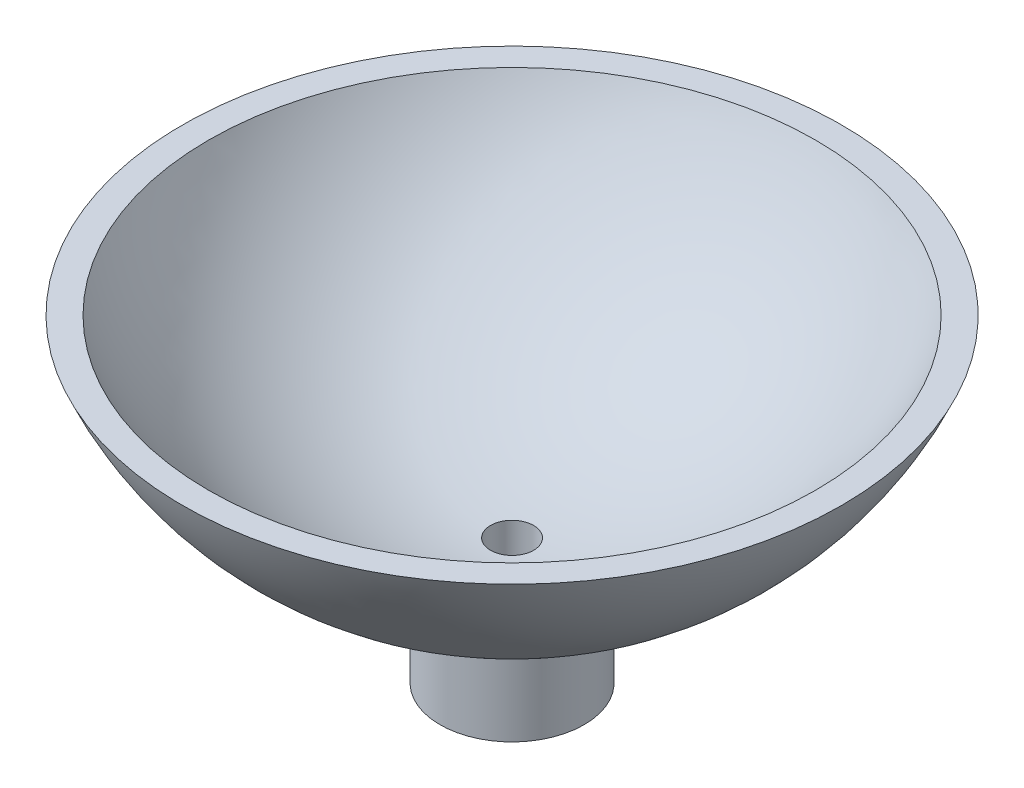
ISO-10303-21;
HEADER;
FILE_DESCRIPTION(('STEP AP214'),'2;1');
FILE_NAME('part.step','',(''),(''),'','','');
FILE_SCHEMA(('AUTOMOTIVE_DESIGN { 1 0 10303 214 1 1 1 1 }'));
ENDSEC;
DATA;
#1=APPLICATION_CONTEXT('core data for automotive mechanical design processes');
#2=APPLICATION_PROTOCOL_DEFINITION('international standard','automotive_design',2000,#1);
#3=PRODUCT_CONTEXT('',#1,'mechanical');
#4=PRODUCT('Part','Part','',(#3));
#5=PRODUCT_RELATED_PRODUCT_CATEGORY('part','',(#4));
#6=PRODUCT_DEFINITION_FORMATION('','',#4);
#7=PRODUCT_DEFINITION_CONTEXT('part definition',#1,'design');
#8=PRODUCT_DEFINITION('design','',#6,#7);
#9=PRODUCT_DEFINITION_SHAPE('','',#8);
#10=(LENGTH_UNIT() NAMED_UNIT(*) SI_UNIT(.MILLI.,.METRE.));
#11=(NAMED_UNIT(*) PLANE_ANGLE_UNIT() SI_UNIT($,.RADIAN.));
#12=(NAMED_UNIT(*) SI_UNIT($,.STERADIAN.) SOLID_ANGLE_UNIT());
#13=UNCERTAINTY_MEASURE_WITH_UNIT(LENGTH_MEASURE(1.E-05),#10,'distance_accuracy_value','');
#14=(GEOMETRIC_REPRESENTATION_CONTEXT(3) GLOBAL_UNCERTAINTY_ASSIGNED_CONTEXT((#13)) GLOBAL_UNIT_ASSIGNED_CONTEXT((#10,
#11,#12)) REPRESENTATION_CONTEXT('',''));
#15=CARTESIAN_POINT('',(0.,0.,0.));
#16=DIRECTION('',(0.,0.,1.));
#17=DIRECTION('',(1.,0.,0.));
#18=AXIS2_PLACEMENT_3D('',#15,#16,#17);
#19=CARTESIAN_POINT('',(0.,-28.85,0.));
#20=DIRECTION('',(0.,-1.,0.));
#21=DIRECTION('',(1.,0.,0.));
#22=AXIS2_PLACEMENT_3D('',#19,#20,#21);
#23=CYLINDRICAL_SURFACE('',#22,4.52755000000001);
#24=CARTESIAN_POINT('',(0.,-28.85,0.));
#25=DIRECTION('',(0.,-1.,0.));
#26=DIRECTION('',(1.,0.,0.));
#27=AXIS2_PLACEMENT_3D('',#24,#25,#26);
#28=CIRCLE('',#27,4.52755);
#29=CARTESIAN_POINT('',(4.52755,-28.85,0.));
#30=VERTEX_POINT('',#29);
#31=EDGE_CURVE('E10',#30,#30,#28,.T.);
#32=ORIENTED_EDGE('',*,*,#31,.F.);
#33=EDGE_LOOP('',(#32));
#34=FACE_BOUND('',#33,.T.);
#35=CARTESIAN_POINT('',(0.,-22.0397661284665,0.));
#36=DIRECTION('',(0.,-1.,0.));
#37=DIRECTION('',(1.,0.,0.));
#38=AXIS2_PLACEMENT_3D('',#35,#36,#37);
#39=CIRCLE('',#38,4.52755000000002);
#40=CARTESIAN_POINT('',(4.52755000000002,-22.0397661284665,0.));
#41=VERTEX_POINT('',#40);
#42=EDGE_CURVE('E64',#41,#41,#39,.T.);
#43=ORIENTED_EDGE('',*,*,#42,.T.);
#44=EDGE_LOOP('',(#43));
#45=FACE_BOUND('',#44,.T.);
#46=ADVANCED_FACE('F37',(#34,#45),#23,.T.);
#47=CARTESIAN_POINT('',(-1.35255,-28.85,0.));
#48=DIRECTION('',(0.,1.,0.));
#49=DIRECTION('',(-1.,0.,0.));
#50=AXIS2_PLACEMENT_3D('',#47,#48,#49);
#51=PLANE('',#50);
#52=CARTESIAN_POINT('',(0.,-28.85,0.));
#53=DIRECTION('',(0.,-1.,0.));
#54=DIRECTION('',(1.,0.,0.));
#55=AXIS2_PLACEMENT_3D('',#52,#53,#54);
#56=CIRCLE('',#55,1.35255);
#57=CARTESIAN_POINT('',(1.35255,-28.85,0.));
#58=VERTEX_POINT('',#57);
#59=EDGE_CURVE('E44',#58,#58,#56,.T.);
#60=ORIENTED_EDGE('',*,*,#59,.F.);
#61=EDGE_LOOP('',(#60));
#62=FACE_BOUND('',#61,.T.);
#63=ORIENTED_EDGE('',*,*,#31,.T.);
#64=EDGE_LOOP('',(#63));
#65=FACE_BOUND('',#64,.T.);
#66=ADVANCED_FACE('F90',(#62,#65),#51,.F.);
#67=CARTESIAN_POINT('',(0.,-28.85,0.));
#68=DIRECTION('',(0.,-1.,0.));
#69=DIRECTION('',(1.,0.,0.));
#70=AXIS2_PLACEMENT_3D('',#67,#68,#69);
#71=CYLINDRICAL_SURFACE('',#70,1.35255);
#72=CARTESIAN_POINT('',(0.,-20.9563977939316,0.));
#73=DIRECTION('',(0.,-1.,0.));
#74=DIRECTION('',(1.,0.,0.));
#75=AXIS2_PLACEMENT_3D('',#72,#73,#74);
#76=CIRCLE('',#75,1.35255);
#77=CARTESIAN_POINT('',(1.35255,-20.9563977939316,0.));
#78=VERTEX_POINT('',#77);
#79=EDGE_CURVE('E49',#78,#78,#76,.T.);
#80=ORIENTED_EDGE('',*,*,#79,.F.);
#81=EDGE_LOOP('',(#80));
#82=FACE_BOUND('',#81,.T.);
#83=ORIENTED_EDGE('',*,*,#59,.T.);
#84=EDGE_LOOP('',(#83));
#85=FACE_BOUND('',#84,.T.);
#86=ADVANCED_FACE('F85',(#82,#85),#71,.F.);
#87=CARTESIAN_POINT('',(0.,0.,0.));
#88=DIRECTION('',(0.,-1.,0.));
#89=DIRECTION('',(-1.,0.,0.));
#90=AXIS2_PLACEMENT_3D('',#87,#88,#89);
#91=SPHERICAL_SURFACE('',#90,21.);
#92=CARTESIAN_POINT('',(0.,-8.85,0.));
#93=DIRECTION('',(0.,-1.,0.));
#94=DIRECTION('',(1.,0.,0.));
#95=AXIS2_PLACEMENT_3D('',#92,#93,#94);
#96=CIRCLE('',#95,19.0440935725489);
#97=CARTESIAN_POINT('',(19.044093572549,-8.85,0.));
#98=VERTEX_POINT('',#97);
#99=EDGE_CURVE('E54',#98,#98,#96,.T.);
#100=ORIENTED_EDGE('',*,*,#99,.F.);
#101=EDGE_LOOP('',(#100));
#102=FACE_BOUND('',#101,.T.);
#103=ORIENTED_EDGE('',*,*,#79,.T.);
#104=EDGE_LOOP('',(#103));
#105=FACE_BOUND('',#104,.T.);
#106=ADVANCED_FACE('F79',(#102,#105),#91,.F.);
#107=CARTESIAN_POINT('',(-20.6864085814817,-8.85,0.));
#108=DIRECTION('',(0.,-1.,0.));
#109=DIRECTION('',(1.,0.,0.));
#110=AXIS2_PLACEMENT_3D('',#107,#108,#109);
#111=PLANE('',#110);
#112=CARTESIAN_POINT('',(0.,-8.85000000000001,0.));
#113=DIRECTION('',(0.,-1.,0.));
#114=DIRECTION('',(1.,0.,0.));
#115=AXIS2_PLACEMENT_3D('',#112,#113,#114);
#116=CIRCLE('',#115,20.6864085814817);
#117=CARTESIAN_POINT('',(20.6864085814817,-8.85000000000001,0.));
#118=VERTEX_POINT('',#117);
#119=EDGE_CURVE('E60',#118,#118,#116,.T.);
#120=ORIENTED_EDGE('',*,*,#119,.F.);
#121=EDGE_LOOP('',(#120));
#122=FACE_BOUND('',#121,.T.);
#123=ORIENTED_EDGE('',*,*,#99,.T.);
#124=EDGE_LOOP('',(#123));
#125=FACE_BOUND('',#124,.T.);
#126=ADVANCED_FACE('F73',(#122,#125),#111,.F.);
#127=CARTESIAN_POINT('',(0.,0.,0.));
#128=DIRECTION('',(0.,-1.,0.));
#129=DIRECTION('',(-1.,0.,0.));
#130=AXIS2_PLACEMENT_3D('',#127,#128,#129);
#131=SPHERICAL_SURFACE('',#130,22.5);
#132=ORIENTED_EDGE('',*,*,#42,.F.);
#133=EDGE_LOOP('',(#132));
#134=FACE_BOUND('',#133,.T.);
#135=ORIENTED_EDGE('',*,*,#119,.T.);
#136=EDGE_LOOP('',(#135));
#137=FACE_BOUND('',#136,.T.);
#138=ADVANCED_FACE('F70',(#134,#137),#131,.T.);
#139=CLOSED_SHELL('',(#46,#66,#86,#106,#126,#138));
#140=MANIFOLD_SOLID_BREP('B2',#139);
#141=ADVANCED_BREP_SHAPE_REPRESENTATION('',(#18,#140),#14);
#142=SHAPE_DEFINITION_REPRESENTATION(#9,#141);
ENDSEC;
END-ISO-10303-21;
